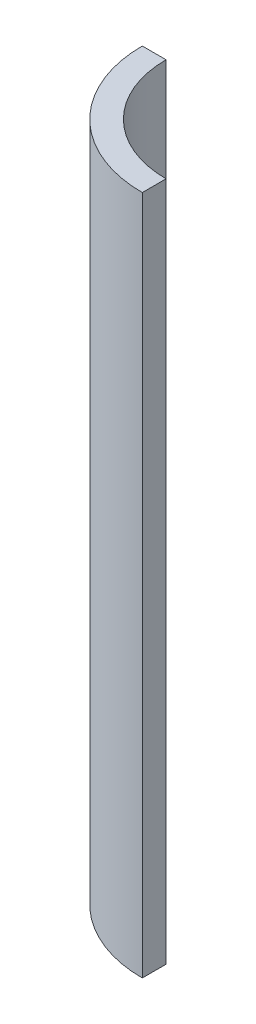
ISO-10303-21;
HEADER;
FILE_DESCRIPTION(('STEP AP214'),'2;1');
FILE_NAME('part.step','',(''),(''),'','','');
FILE_SCHEMA(('AUTOMOTIVE_DESIGN { 1 0 10303 214 1 1 1 1 }'));
ENDSEC;
DATA;
#1=APPLICATION_CONTEXT('core data for automotive mechanical design processes');
#2=APPLICATION_PROTOCOL_DEFINITION('international standard','automotive_design',2000,#1);
#3=PRODUCT_CONTEXT('',#1,'mechanical');
#4=PRODUCT('Part','Part','',(#3));
#5=PRODUCT_RELATED_PRODUCT_CATEGORY('part','',(#4));
#6=PRODUCT_DEFINITION_FORMATION('','',#4);
#7=PRODUCT_DEFINITION_CONTEXT('part definition',#1,'design');
#8=PRODUCT_DEFINITION('design','',#6,#7);
#9=PRODUCT_DEFINITION_SHAPE('','',#8);
#10=(LENGTH_UNIT() NAMED_UNIT(*) SI_UNIT(.MILLI.,.METRE.));
#11=(NAMED_UNIT(*) PLANE_ANGLE_UNIT() SI_UNIT($,.RADIAN.));
#12=(NAMED_UNIT(*) SI_UNIT($,.STERADIAN.) SOLID_ANGLE_UNIT());
#13=UNCERTAINTY_MEASURE_WITH_UNIT(LENGTH_MEASURE(1.E-05),#10,'distance_accuracy_value','');
#14=(GEOMETRIC_REPRESENTATION_CONTEXT(3) GLOBAL_UNCERTAINTY_ASSIGNED_CONTEXT((#13)) GLOBAL_UNIT_ASSIGNED_CONTEXT((#10,
#11,#12)) REPRESENTATION_CONTEXT('',''));
#15=CARTESIAN_POINT('',(0.,0.,0.));
#16=DIRECTION('',(0.,0.,1.));
#17=DIRECTION('',(1.,0.,0.));
#18=AXIS2_PLACEMENT_3D('',#15,#16,#17);
#19=CARTESIAN_POINT('',(0.,544.576,0.));
#20=DIRECTION('',(0.,-1.,0.));
#21=DIRECTION('',(0.,0.,-1.));
#22=AXIS2_PLACEMENT_3D('',#19,#20,#21);
#23=CYLINDRICAL_SURFACE('',#22,101.6);
#24=CARTESIAN_POINT('',(0.,0.,0.));
#25=DIRECTION('',(0.,1.,0.));
#26=DIRECTION('',(0.,0.,1.));
#27=AXIS2_PLACEMENT_3D('',#24,#25,#26);
#28=CIRCLE('',#27,101.6);
#29=CARTESIAN_POINT('',(-101.6,0.,0.));
#30=VERTEX_POINT('',#29);
#31=CARTESIAN_POINT('',(0.,0.,101.6));
#32=VERTEX_POINT('',#31);
#33=EDGE_CURVE('E96',#30,#32,#28,.T.);
#34=ORIENTED_EDGE('',*,*,#33,.T.);
#35=DIRECTION('',(0.,-1.,0.));
#36=VECTOR('',#35,1.);
#37=CARTESIAN_POINT('',(0.,544.576,101.6));
#38=LINE('',#37,#36);
#39=CARTESIAN_POINT('',(0.,544.576,101.6));
#40=VERTEX_POINT('',#39);
#41=EDGE_CURVE('E11',#40,#32,#38,.T.);
#42=ORIENTED_EDGE('',*,*,#41,.F.);
#43=CARTESIAN_POINT('',(0.,544.576,0.));
#44=DIRECTION('',(0.,1.,0.));
#45=DIRECTION('',(0.,0.,1.));
#46=AXIS2_PLACEMENT_3D('',#43,#44,#45);
#47=CIRCLE('',#46,101.6);
#48=CARTESIAN_POINT('',(-101.6,544.576,0.));
#49=VERTEX_POINT('',#48);
#50=EDGE_CURVE('E84',#49,#40,#47,.T.);
#51=ORIENTED_EDGE('',*,*,#50,.F.);
#52=DIRECTION('',(0.,-1.,0.));
#53=VECTOR('',#52,1.);
#54=CARTESIAN_POINT('',(-101.6,544.576,0.));
#55=LINE('',#54,#53);
#56=EDGE_CURVE('E92',#49,#30,#55,.T.);
#57=ORIENTED_EDGE('',*,*,#56,.T.);
#58=EDGE_LOOP('',(#34,#42,#51,#57));
#59=FACE_BOUND('',#58,.T.);
#60=ADVANCED_FACE('F33',(#59),#23,.T.);
#61=CARTESIAN_POINT('',(0.,544.576,82.55));
#62=DIRECTION('',(-1.,0.,0.));
#63=DIRECTION('',(0.,0.,1.));
#64=AXIS2_PLACEMENT_3D('',#61,#62,#63);
#65=PLANE('',#64);
#66=DIRECTION('',(0.,0.,-1.));
#67=VECTOR('',#66,1.);
#68=CARTESIAN_POINT('',(0.,0.,82.55));
#69=LINE('',#68,#67);
#70=CARTESIAN_POINT('',(0.,0.,82.55));
#71=VERTEX_POINT('',#70);
#72=EDGE_CURVE('E88',#32,#71,#69,.T.);
#73=ORIENTED_EDGE('',*,*,#72,.T.);
#74=DIRECTION('',(0.,-1.,0.));
#75=VECTOR('',#74,1.);
#76=CARTESIAN_POINT('',(0.,544.576,82.55));
#77=LINE('',#76,#75);
#78=CARTESIAN_POINT('',(0.,544.576,82.55));
#79=VERTEX_POINT('',#78);
#80=EDGE_CURVE('E41',#79,#71,#77,.T.);
#81=ORIENTED_EDGE('',*,*,#80,.F.);
#82=DIRECTION('',(0.,0.,-1.));
#83=VECTOR('',#82,1.);
#84=CARTESIAN_POINT('',(0.,544.576,82.55));
#85=LINE('',#84,#83);
#86=EDGE_CURVE('E79',#40,#79,#85,.T.);
#87=ORIENTED_EDGE('',*,*,#86,.F.);
#88=ORIENTED_EDGE('',*,*,#41,.T.);
#89=EDGE_LOOP('',(#73,#81,#87,#88));
#90=FACE_BOUND('',#89,.T.);
#91=ADVANCED_FACE('F87',(#90),#65,.F.);
#92=CARTESIAN_POINT('',(0.,544.576,0.));
#93=DIRECTION('',(0.,-1.,0.));
#94=DIRECTION('',(0.,0.,-1.));
#95=AXIS2_PLACEMENT_3D('',#92,#93,#94);
#96=CYLINDRICAL_SURFACE('',#95,82.55);
#97=CARTESIAN_POINT('',(0.,0.,0.));
#98=DIRECTION('',(0.,-1.,0.));
#99=DIRECTION('',(0.,0.,1.));
#100=AXIS2_PLACEMENT_3D('',#97,#98,#99);
#101=CIRCLE('',#100,82.55);
#102=CARTESIAN_POINT('',(-82.55,0.,0.));
#103=VERTEX_POINT('',#102);
#104=EDGE_CURVE('E66',#71,#103,#101,.T.);
#105=ORIENTED_EDGE('',*,*,#104,.T.);
#106=DIRECTION('',(0.,-1.,0.));
#107=VECTOR('',#106,1.);
#108=CARTESIAN_POINT('',(-82.55,544.576,0.));
#109=LINE('',#108,#107);
#110=CARTESIAN_POINT('',(-82.55,544.576,0.));
#111=VERTEX_POINT('',#110);
#112=EDGE_CURVE('E89',#111,#103,#109,.T.);
#113=ORIENTED_EDGE('',*,*,#112,.F.);
#114=CARTESIAN_POINT('',(0.,544.576,0.));
#115=DIRECTION('',(0.,-1.,0.));
#116=DIRECTION('',(0.,0.,1.));
#117=AXIS2_PLACEMENT_3D('',#114,#115,#116);
#118=CIRCLE('',#117,82.55);
#119=EDGE_CURVE('E82',#79,#111,#118,.T.);
#120=ORIENTED_EDGE('',*,*,#119,.F.);
#121=ORIENTED_EDGE('',*,*,#80,.T.);
#122=EDGE_LOOP('',(#105,#113,#120,#121));
#123=FACE_BOUND('',#122,.T.);
#124=ADVANCED_FACE('F90',(#123),#96,.F.);
#125=CARTESIAN_POINT('',(-82.55,544.576,0.));
#126=DIRECTION('',(0.,0.,1.));
#127=DIRECTION('',(1.,0.,0.));
#128=AXIS2_PLACEMENT_3D('',#125,#126,#127);
#129=PLANE('',#128);
#130=DIRECTION('',(-1.,0.,0.));
#131=VECTOR('',#130,1.);
#132=CARTESIAN_POINT('',(-82.55,0.,0.));
#133=LINE('',#132,#131);
#134=EDGE_CURVE('E72',#103,#30,#133,.T.);
#135=ORIENTED_EDGE('',*,*,#134,.T.);
#136=ORIENTED_EDGE('',*,*,#56,.F.);
#137=DIRECTION('',(-1.,0.,0.));
#138=VECTOR('',#137,1.);
#139=CARTESIAN_POINT('',(-82.55,544.576,0.));
#140=LINE('',#139,#138);
#141=EDGE_CURVE('E49',#111,#49,#140,.T.);
#142=ORIENTED_EDGE('',*,*,#141,.F.);
#143=ORIENTED_EDGE('',*,*,#112,.T.);
#144=EDGE_LOOP('',(#135,#136,#142,#143));
#145=FACE_BOUND('',#144,.T.);
#146=ADVANCED_FACE('F103',(#145),#129,.F.);
#147=CARTESIAN_POINT('',(0.,544.576,0.));
#148=DIRECTION('',(0.,1.,0.));
#149=DIRECTION('',(0.,0.,1.));
#150=AXIS2_PLACEMENT_3D('',#147,#148,#149);
#151=PLANE('',#150);
#152=ORIENTED_EDGE('',*,*,#50,.T.);
#153=ORIENTED_EDGE('',*,*,#86,.T.);
#154=ORIENTED_EDGE('',*,*,#119,.T.);
#155=ORIENTED_EDGE('',*,*,#141,.T.);
#156=EDGE_LOOP('',(#152,#153,#154,#155));
#157=FACE_BOUND('',#156,.T.);
#158=ADVANCED_FACE('F80',(#157),#151,.T.);
#159=CARTESIAN_POINT('',(0.,0.,0.));
#160=DIRECTION('',(0.,1.,0.));
#161=DIRECTION('',(0.,0.,1.));
#162=AXIS2_PLACEMENT_3D('',#159,#160,#161);
#163=PLANE('',#162);
#164=ORIENTED_EDGE('',*,*,#33,.F.);
#165=ORIENTED_EDGE('',*,*,#134,.F.);
#166=ORIENTED_EDGE('',*,*,#104,.F.);
#167=ORIENTED_EDGE('',*,*,#72,.F.);
#168=EDGE_LOOP('',(#164,#165,#166,#167));
#169=FACE_BOUND('',#168,.T.);
#170=ADVANCED_FACE('F106',(#169),#163,.F.);
#171=CLOSED_SHELL('',(#60,#91,#124,#146,#158,#170));
#172=MANIFOLD_SOLID_BREP('B2',#171);
#173=ADVANCED_BREP_SHAPE_REPRESENTATION('',(#18,#172),#14);
#174=SHAPE_DEFINITION_REPRESENTATION(#9,#173);
ENDSEC;
END-ISO-10303-21;
